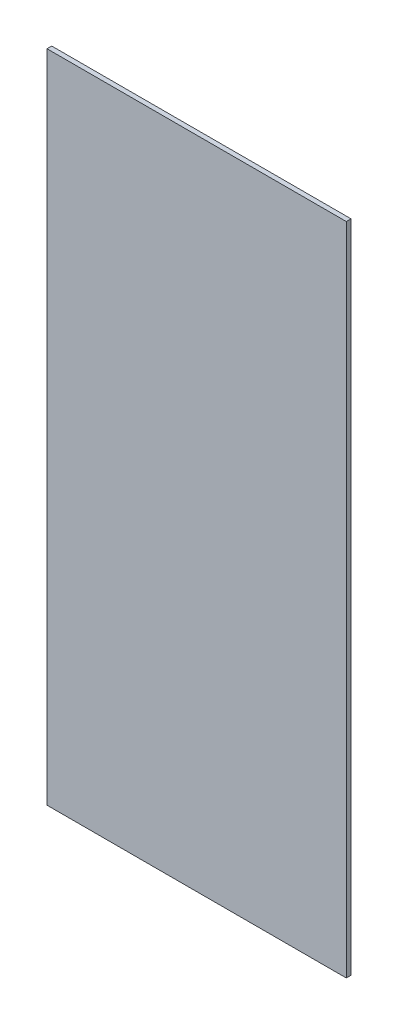
ISO-10303-21;
HEADER;
FILE_DESCRIPTION(('STEP AP214'),'2;1');
FILE_NAME('part.step','',(''),(''),'','','');
FILE_SCHEMA(('AUTOMOTIVE_DESIGN { 1 0 10303 214 1 1 1 1 }'));
ENDSEC;
DATA;
#1=APPLICATION_CONTEXT('core data for automotive mechanical design processes');
#2=APPLICATION_PROTOCOL_DEFINITION('international standard','automotive_design',2000,#1);
#3=PRODUCT_CONTEXT('',#1,'mechanical');
#4=PRODUCT('Part','Part','',(#3));
#5=PRODUCT_RELATED_PRODUCT_CATEGORY('part','',(#4));
#6=PRODUCT_DEFINITION_FORMATION('','',#4);
#7=PRODUCT_DEFINITION_CONTEXT('part definition',#1,'design');
#8=PRODUCT_DEFINITION('design','',#6,#7);
#9=PRODUCT_DEFINITION_SHAPE('','',#8);
#10=(LENGTH_UNIT() NAMED_UNIT(*) SI_UNIT(.MILLI.,.METRE.));
#11=(NAMED_UNIT(*) PLANE_ANGLE_UNIT() SI_UNIT($,.RADIAN.));
#12=(NAMED_UNIT(*) SI_UNIT($,.STERADIAN.) SOLID_ANGLE_UNIT());
#13=UNCERTAINTY_MEASURE_WITH_UNIT(LENGTH_MEASURE(1.E-05),#10,'distance_accuracy_value','');
#14=(GEOMETRIC_REPRESENTATION_CONTEXT(3) GLOBAL_UNCERTAINTY_ASSIGNED_CONTEXT((#13)) GLOBAL_UNIT_ASSIGNED_CONTEXT((#10,
#11,#12)) REPRESENTATION_CONTEXT('',''));
#15=CARTESIAN_POINT('',(0.,0.,0.));
#16=DIRECTION('',(0.,0.,1.));
#17=DIRECTION('',(1.,0.,0.));
#18=AXIS2_PLACEMENT_3D('',#15,#16,#17);
#19=CARTESIAN_POINT('',(51.6256,113.,1.6256));
#20=DIRECTION('',(-1.,0.,0.));
#21=DIRECTION('',(0.,-1.,0.));
#22=AXIS2_PLACEMENT_3D('',#19,#20,#21);
#23=PLANE('',#22);
#24=DIRECTION('',(0.,1.,0.));
#25=VECTOR('',#24,1.);
#26=CARTESIAN_POINT('',(51.6256,113.,0.));
#27=LINE('',#26,#25);
#28=CARTESIAN_POINT('',(51.6256,-113.,0.));
#29=VERTEX_POINT('',#28);
#30=CARTESIAN_POINT('',(51.6256,113.,0.));
#31=VERTEX_POINT('',#30);
#32=EDGE_CURVE('E96',#29,#31,#27,.T.);
#33=ORIENTED_EDGE('',*,*,#32,.T.);
#34=DIRECTION('',(0.,0.,-1.));
#35=VECTOR('',#34,1.);
#36=CARTESIAN_POINT('',(51.6256,113.,1.6256));
#37=LINE('',#36,#35);
#38=CARTESIAN_POINT('',(51.6256,113.,1.6256));
#39=VERTEX_POINT('',#38);
#40=EDGE_CURVE('E11',#39,#31,#37,.T.);
#41=ORIENTED_EDGE('',*,*,#40,.F.);
#42=DIRECTION('',(0.,1.,0.));
#43=VECTOR('',#42,1.);
#44=CARTESIAN_POINT('',(51.6256,113.,1.6256));
#45=LINE('',#44,#43);
#46=CARTESIAN_POINT('',(51.6256,-113.,1.6256));
#47=VERTEX_POINT('',#46);
#48=EDGE_CURVE('E84',#47,#39,#45,.T.);
#49=ORIENTED_EDGE('',*,*,#48,.F.);
#50=DIRECTION('',(0.,0.,-1.));
#51=VECTOR('',#50,1.);
#52=CARTESIAN_POINT('',(51.6256,-113.,1.6256));
#53=LINE('',#52,#51);
#54=EDGE_CURVE('E92',#47,#29,#53,.T.);
#55=ORIENTED_EDGE('',*,*,#54,.T.);
#56=EDGE_LOOP('',(#33,#41,#49,#55));
#57=FACE_BOUND('',#56,.T.);
#58=ADVANCED_FACE('F33',(#57),#23,.F.);
#59=CARTESIAN_POINT('',(-51.6256,113.,1.6256));
#60=DIRECTION('',(0.,-1.,0.));
#61=DIRECTION('',(0.,0.,-1.));
#62=AXIS2_PLACEMENT_3D('',#59,#60,#61);
#63=PLANE('',#62);
#64=DIRECTION('',(-1.,0.,0.));
#65=VECTOR('',#64,1.);
#66=CARTESIAN_POINT('',(-51.6256,113.,0.));
#67=LINE('',#66,#65);
#68=CARTESIAN_POINT('',(-51.6256,113.,0.));
#69=VERTEX_POINT('',#68);
#70=EDGE_CURVE('E88',#31,#69,#67,.T.);
#71=ORIENTED_EDGE('',*,*,#70,.T.);
#72=DIRECTION('',(0.,0.,-1.));
#73=VECTOR('',#72,1.);
#74=CARTESIAN_POINT('',(-51.6256,113.,1.6256));
#75=LINE('',#74,#73);
#76=CARTESIAN_POINT('',(-51.6256,113.,1.6256));
#77=VERTEX_POINT('',#76);
#78=EDGE_CURVE('E41',#77,#69,#75,.T.);
#79=ORIENTED_EDGE('',*,*,#78,.F.);
#80=DIRECTION('',(-1.,0.,0.));
#81=VECTOR('',#80,1.);
#82=CARTESIAN_POINT('',(-51.6256,113.,1.6256));
#83=LINE('',#82,#81);
#84=EDGE_CURVE('E79',#39,#77,#83,.T.);
#85=ORIENTED_EDGE('',*,*,#84,.F.);
#86=ORIENTED_EDGE('',*,*,#40,.T.);
#87=EDGE_LOOP('',(#71,#79,#85,#86));
#88=FACE_BOUND('',#87,.T.);
#89=ADVANCED_FACE('F87',(#88),#63,.F.);
#90=CARTESIAN_POINT('',(-51.6256,113.,1.6256));
#91=DIRECTION('',(1.,0.,0.));
#92=DIRECTION('',(0.,1.,0.));
#93=AXIS2_PLACEMENT_3D('',#90,#91,#92);
#94=PLANE('',#93);
#95=DIRECTION('',(0.,-1.,0.));
#96=VECTOR('',#95,1.);
#97=CARTESIAN_POINT('',(-51.6256,113.,0.));
#98=LINE('',#97,#96);
#99=CARTESIAN_POINT('',(-51.6256,-113.,0.));
#100=VERTEX_POINT('',#99);
#101=EDGE_CURVE('E66',#69,#100,#98,.T.);
#102=ORIENTED_EDGE('',*,*,#101,.T.);
#103=DIRECTION('',(0.,0.,-1.));
#104=VECTOR('',#103,1.);
#105=CARTESIAN_POINT('',(-51.6256,-113.,1.6256));
#106=LINE('',#105,#104);
#107=CARTESIAN_POINT('',(-51.6256,-113.,1.6256));
#108=VERTEX_POINT('',#107);
#109=EDGE_CURVE('E89',#108,#100,#106,.T.);
#110=ORIENTED_EDGE('',*,*,#109,.F.);
#111=DIRECTION('',(0.,-1.,0.));
#112=VECTOR('',#111,1.);
#113=CARTESIAN_POINT('',(-51.6256,113.,1.6256));
#114=LINE('',#113,#112);
#115=EDGE_CURVE('E82',#77,#108,#114,.T.);
#116=ORIENTED_EDGE('',*,*,#115,.F.);
#117=ORIENTED_EDGE('',*,*,#78,.T.);
#118=EDGE_LOOP('',(#102,#110,#116,#117));
#119=FACE_BOUND('',#118,.T.);
#120=ADVANCED_FACE('F90',(#119),#94,.F.);
#121=CARTESIAN_POINT('',(-51.6256,-113.,1.6256));
#122=DIRECTION('',(0.,1.,0.));
#123=DIRECTION('',(0.,0.,1.));
#124=AXIS2_PLACEMENT_3D('',#121,#122,#123);
#125=PLANE('',#124);
#126=DIRECTION('',(1.,0.,0.));
#127=VECTOR('',#126,1.);
#128=CARTESIAN_POINT('',(-51.6256,-113.,0.));
#129=LINE('',#128,#127);
#130=EDGE_CURVE('E72',#100,#29,#129,.T.);
#131=ORIENTED_EDGE('',*,*,#130,.T.);
#132=ORIENTED_EDGE('',*,*,#54,.F.);
#133=DIRECTION('',(1.,0.,0.));
#134=VECTOR('',#133,1.);
#135=CARTESIAN_POINT('',(-51.6256,-113.,1.6256));
#136=LINE('',#135,#134);
#137=EDGE_CURVE('E49',#108,#47,#136,.T.);
#138=ORIENTED_EDGE('',*,*,#137,.F.);
#139=ORIENTED_EDGE('',*,*,#109,.T.);
#140=EDGE_LOOP('',(#131,#132,#138,#139));
#141=FACE_BOUND('',#140,.T.);
#142=ADVANCED_FACE('F103',(#141),#125,.F.);
#143=CARTESIAN_POINT('',(0.,0.,1.6256));
#144=DIRECTION('',(0.,0.,1.));
#145=DIRECTION('',(1.,0.,0.));
#146=AXIS2_PLACEMENT_3D('',#143,#144,#145);
#147=PLANE('',#146);
#148=ORIENTED_EDGE('',*,*,#48,.T.);
#149=ORIENTED_EDGE('',*,*,#84,.T.);
#150=ORIENTED_EDGE('',*,*,#115,.T.);
#151=ORIENTED_EDGE('',*,*,#137,.T.);
#152=EDGE_LOOP('',(#148,#149,#150,#151));
#153=FACE_BOUND('',#152,.T.);
#154=ADVANCED_FACE('F80',(#153),#147,.T.);
#155=CARTESIAN_POINT('',(0.,0.,0.));
#156=DIRECTION('',(0.,0.,1.));
#157=DIRECTION('',(1.,0.,0.));
#158=AXIS2_PLACEMENT_3D('',#155,#156,#157);
#159=PLANE('',#158);
#160=ORIENTED_EDGE('',*,*,#32,.F.);
#161=ORIENTED_EDGE('',*,*,#130,.F.);
#162=ORIENTED_EDGE('',*,*,#101,.F.);
#163=ORIENTED_EDGE('',*,*,#70,.F.);
#164=EDGE_LOOP('',(#160,#161,#162,#163));
#165=FACE_BOUND('',#164,.T.);
#166=ADVANCED_FACE('F106',(#165),#159,.F.);
#167=CLOSED_SHELL('',(#58,#89,#120,#142,#154,#166));
#168=MANIFOLD_SOLID_BREP('B2',#167);
#169=ADVANCED_BREP_SHAPE_REPRESENTATION('',(#18,#168),#14);
#170=SHAPE_DEFINITION_REPRESENTATION(#9,#169);
ENDSEC;
END-ISO-10303-21;
